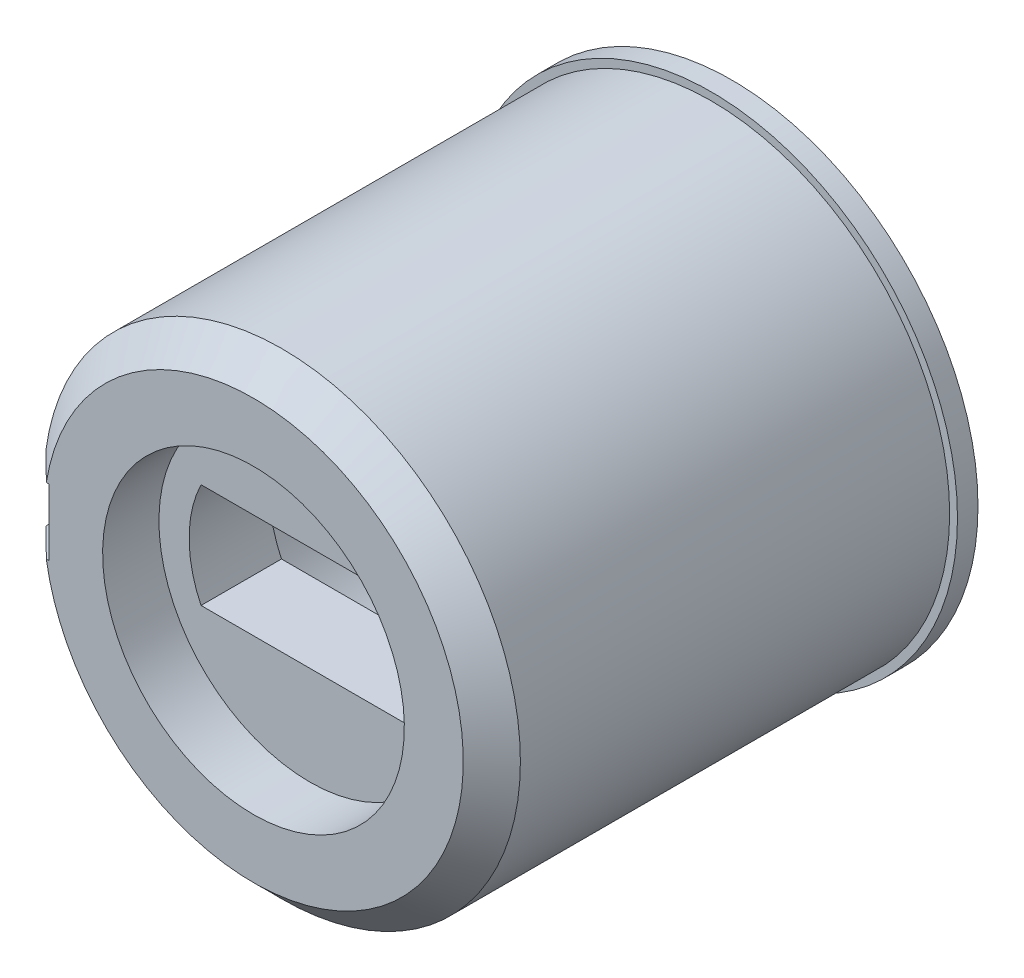
ISO-10303-21;
HEADER;
FILE_DESCRIPTION(('STEP AP214'),'2;1');
FILE_NAME('part.step','',(''),(''),'','','');
FILE_SCHEMA(('AUTOMOTIVE_DESIGN { 1 0 10303 214 1 1 1 1 }'));
ENDSEC;
DATA;
#1=APPLICATION_CONTEXT('core data for automotive mechanical design processes');
#2=APPLICATION_PROTOCOL_DEFINITION('international standard','automotive_design',2000,#1);
#3=PRODUCT_CONTEXT('',#1,'mechanical');
#4=PRODUCT('Part','Part','',(#3));
#5=PRODUCT_RELATED_PRODUCT_CATEGORY('part','',(#4));
#6=PRODUCT_DEFINITION_FORMATION('','',#4);
#7=PRODUCT_DEFINITION_CONTEXT('part definition',#1,'design');
#8=PRODUCT_DEFINITION('design','',#6,#7);
#9=PRODUCT_DEFINITION_SHAPE('','',#8);
#10=(LENGTH_UNIT() NAMED_UNIT(*) SI_UNIT(.MILLI.,.METRE.));
#11=(NAMED_UNIT(*) PLANE_ANGLE_UNIT() SI_UNIT($,.RADIAN.));
#12=(NAMED_UNIT(*) SI_UNIT($,.STERADIAN.) SOLID_ANGLE_UNIT());
#13=UNCERTAINTY_MEASURE_WITH_UNIT(LENGTH_MEASURE(1.E-05),#10,'distance_accuracy_value','');
#14=(GEOMETRIC_REPRESENTATION_CONTEXT(3) GLOBAL_UNCERTAINTY_ASSIGNED_CONTEXT((#13)) GLOBAL_UNIT_ASSIGNED_CONTEXT((#10,
#11,#12)) REPRESENTATION_CONTEXT('',''));
#15=CARTESIAN_POINT('',(0.,0.,0.));
#16=DIRECTION('',(0.,0.,1.));
#17=DIRECTION('',(1.,0.,0.));
#18=AXIS2_PLACEMENT_3D('',#15,#16,#17);
#19=CARTESIAN_POINT('',(-2.70370116691916,-1.30000000000001,18.87));
#20=DIRECTION('',(0.,-1.,0.));
#21=DIRECTION('',(0.,0.,-1.));
#22=AXIS2_PLACEMENT_3D('',#19,#20,#21);
#23=PLANE('',#22);
#24=DIRECTION('',(0.,0.,-1.));
#25=VECTOR('',#24,1.);
#26=CARTESIAN_POINT('',(-2.70370116691915,-1.30000000000001,18.87));
#27=LINE('',#26,#25);
#28=CARTESIAN_POINT('',(-2.70370116691915,-1.30000000000001,16.87));
#29=VERTEX_POINT('',#28);
#30=CARTESIAN_POINT('',(-2.70370116691915,-1.30000000000001,18.87));
#31=VERTEX_POINT('',#30);
#32=EDGE_CURVE('E95',#29,#31,#27,.F.);
#33=ORIENTED_EDGE('',*,*,#32,.T.);
#34=DIRECTION('',(-1.,0.,0.));
#35=VECTOR('',#34,1.);
#36=CARTESIAN_POINT('',(0.,-1.30000000000001,18.87));
#37=LINE('',#36,#35);
#38=CARTESIAN_POINT('',(2.70370116691916,-1.3,18.87));
#39=VERTEX_POINT('',#38);
#40=EDGE_CURVE('E186',#31,#39,#37,.F.);
#41=ORIENTED_EDGE('',*,*,#40,.T.);
#42=DIRECTION('',(0.,0.,-1.));
#43=VECTOR('',#42,1.);
#44=CARTESIAN_POINT('',(2.70370116691916,-1.3,18.87));
#45=LINE('',#44,#43);
#46=CARTESIAN_POINT('',(2.70370116691916,-1.3,16.87));
#47=VERTEX_POINT('',#46);
#48=EDGE_CURVE('E109',#39,#47,#45,.T.);
#49=ORIENTED_EDGE('',*,*,#48,.T.);
#50=DIRECTION('',(-1.,0.,0.));
#51=VECTOR('',#50,1.);
#52=CARTESIAN_POINT('',(0.,-1.30000000000001,16.87));
#53=LINE('',#52,#51);
#54=EDGE_CURVE('E107',#29,#47,#53,.F.);
#55=ORIENTED_EDGE('',*,*,#54,.F.);
#56=EDGE_LOOP('',(#33,#41,#49,#55));
#57=FACE_BOUND('',#56,.T.);
#58=ADVANCED_FACE('F16',(#57),#23,.F.);
#59=CARTESIAN_POINT('',(0.,0.,18.87));
#60=DIRECTION('',(0.,0.,-1.));
#61=DIRECTION('',(0.,1.,0.));
#62=AXIS2_PLACEMENT_3D('',#59,#60,#61);
#63=CYLINDRICAL_SURFACE('',#62,3.);
#64=ORIENTED_EDGE('',*,*,#48,.F.);
#65=CARTESIAN_POINT('',(0.,0.,18.87));
#66=DIRECTION('',(0.,0.,-1.));
#67=DIRECTION('',(0.,1.,0.));
#68=AXIS2_PLACEMENT_3D('',#65,#66,#67);
#69=CIRCLE('',#68,3.);
#70=CARTESIAN_POINT('',(2.70370116691915,1.3,18.87));
#71=VERTEX_POINT('',#70);
#72=EDGE_CURVE('E185',#39,#71,#69,.F.);
#73=ORIENTED_EDGE('',*,*,#72,.T.);
#74=DIRECTION('',(0.,0.,1.));
#75=VECTOR('',#74,1.);
#76=CARTESIAN_POINT('',(2.70370116691915,1.3,18.87));
#77=LINE('',#76,#75);
#78=CARTESIAN_POINT('',(2.70370116691915,1.3,16.87));
#79=VERTEX_POINT('',#78);
#80=EDGE_CURVE('E104',#71,#79,#77,.F.);
#81=ORIENTED_EDGE('',*,*,#80,.T.);
#82=CARTESIAN_POINT('',(0.,0.,16.87));
#83=DIRECTION('',(0.,0.,-1.));
#84=DIRECTION('',(0.,1.,0.));
#85=AXIS2_PLACEMENT_3D('',#82,#83,#84);
#86=CIRCLE('',#85,3.);
#87=EDGE_CURVE('E113',#47,#79,#86,.F.);
#88=ORIENTED_EDGE('',*,*,#87,.F.);
#89=EDGE_LOOP('',(#64,#73,#81,#88));
#90=FACE_BOUND('',#89,.T.);
#91=ADVANCED_FACE('F368',(#90),#63,.F.);
#92=CARTESIAN_POINT('',(2.70370116691915,1.3,18.87));
#93=DIRECTION('',(0.,1.,0.));
#94=DIRECTION('',(0.,0.,1.));
#95=AXIS2_PLACEMENT_3D('',#92,#93,#94);
#96=PLANE('',#95);
#97=ORIENTED_EDGE('',*,*,#80,.F.);
#98=DIRECTION('',(-1.,0.,0.));
#99=VECTOR('',#98,1.);
#100=CARTESIAN_POINT('',(0.,1.3,18.87));
#101=LINE('',#100,#99);
#102=CARTESIAN_POINT('',(-2.70370116691915,1.3,18.87));
#103=VERTEX_POINT('',#102);
#104=EDGE_CURVE('E184',#71,#103,#101,.T.);
#105=ORIENTED_EDGE('',*,*,#104,.T.);
#106=DIRECTION('',(0.,0.,-1.));
#107=VECTOR('',#106,1.);
#108=CARTESIAN_POINT('',(-2.70370116691915,1.3,18.87));
#109=LINE('',#108,#107);
#110=CARTESIAN_POINT('',(-2.70370116691915,1.3,16.87));
#111=VERTEX_POINT('',#110);
#112=EDGE_CURVE('E90',#103,#111,#109,.T.);
#113=ORIENTED_EDGE('',*,*,#112,.T.);
#114=DIRECTION('',(-1.,0.,0.));
#115=VECTOR('',#114,1.);
#116=CARTESIAN_POINT('',(0.,1.3,16.87));
#117=LINE('',#116,#115);
#118=EDGE_CURVE('E117',#79,#111,#117,.T.);
#119=ORIENTED_EDGE('',*,*,#118,.F.);
#120=EDGE_LOOP('',(#97,#105,#113,#119));
#121=FACE_BOUND('',#120,.T.);
#122=ADVANCED_FACE('F359',(#121),#96,.F.);
#123=CARTESIAN_POINT('',(0.,0.,18.87));
#124=DIRECTION('',(0.,0.,-1.));
#125=DIRECTION('',(0.,1.,0.));
#126=AXIS2_PLACEMENT_3D('',#123,#124,#125);
#127=CYLINDRICAL_SURFACE('',#126,3.);
#128=ORIENTED_EDGE('',*,*,#112,.F.);
#129=CARTESIAN_POINT('',(0.,0.,18.87));
#130=DIRECTION('',(0.,0.,-1.));
#131=DIRECTION('',(0.,1.,0.));
#132=AXIS2_PLACEMENT_3D('',#129,#130,#131);
#133=CIRCLE('',#132,3.);
#134=EDGE_CURVE('E101',#103,#31,#133,.F.);
#135=ORIENTED_EDGE('',*,*,#134,.T.);
#136=ORIENTED_EDGE('',*,*,#32,.F.);
#137=CARTESIAN_POINT('',(0.,0.,16.87));
#138=DIRECTION('',(0.,0.,-1.));
#139=DIRECTION('',(0.,1.,0.));
#140=AXIS2_PLACEMENT_3D('',#137,#138,#139);
#141=CIRCLE('',#140,3.);
#142=EDGE_CURVE('E19',#111,#29,#141,.F.);
#143=ORIENTED_EDGE('',*,*,#142,.F.);
#144=EDGE_LOOP('',(#128,#135,#136,#143));
#145=FACE_BOUND('',#144,.T.);
#146=ADVANCED_FACE('F97',(#145),#127,.F.);
#147=CARTESIAN_POINT('',(0.,0.,16.87));
#148=DIRECTION('',(0.,0.,-1.));
#149=DIRECTION('',(-1.,0.,0.));
#150=AXIS2_PLACEMENT_3D('',#147,#148,#149);
#151=PLANE('',#150);
#152=ORIENTED_EDGE('',*,*,#87,.T.);
#153=ORIENTED_EDGE('',*,*,#118,.T.);
#154=ORIENTED_EDGE('',*,*,#142,.T.);
#155=ORIENTED_EDGE('',*,*,#54,.T.);
#156=EDGE_LOOP('',(#152,#153,#154,#155));
#157=FACE_BOUND('',#156,.T.);
#158=CARTESIAN_POINT('',(0.,0.,16.87));
#159=DIRECTION('',(0.,0.,1.));
#160=DIRECTION('',(0.,-1.,0.));
#161=AXIS2_PLACEMENT_3D('',#158,#159,#160);
#162=CIRCLE('',#161,3.75);
#163=CARTESIAN_POINT('',(0.,-3.75,16.87));
#164=VERTEX_POINT('',#163);
#165=EDGE_CURVE('E180',#164,#164,#162,.F.);
#166=ORIENTED_EDGE('',*,*,#165,.T.);
#167=EDGE_LOOP('',(#166));
#168=FACE_BOUND('',#167,.T.);
#169=ADVANCED_FACE('F115',(#157,#168),#151,.T.);
#170=CARTESIAN_POINT('',(0.,0.,18.87));
#171=DIRECTION('',(0.,0.,-1.));
#172=DIRECTION('',(-1.,0.,0.));
#173=AXIS2_PLACEMENT_3D('',#170,#171,#172);
#174=PLANE('',#173);
#175=ORIENTED_EDGE('',*,*,#104,.F.);
#176=ORIENTED_EDGE('',*,*,#72,.F.);
#177=ORIENTED_EDGE('',*,*,#40,.F.);
#178=ORIENTED_EDGE('',*,*,#134,.F.);
#179=EDGE_LOOP('',(#175,#176,#177,#178));
#180=FACE_BOUND('',#179,.T.);
#181=CARTESIAN_POINT('',(0.,0.,18.87));
#182=DIRECTION('',(0.,0.,1.));
#183=DIRECTION('',(0.,-1.,0.));
#184=AXIS2_PLACEMENT_3D('',#181,#182,#183);
#185=CIRCLE('',#184,3.75);
#186=CARTESIAN_POINT('',(0.,-3.75,18.87));
#187=VERTEX_POINT('',#186);
#188=EDGE_CURVE('E176',#187,#187,#185,.T.);
#189=ORIENTED_EDGE('',*,*,#188,.T.);
#190=EDGE_LOOP('',(#189));
#191=FACE_BOUND('',#190,.T.);
#192=ADVANCED_FACE('F332',(#180,#191),#174,.F.);
#193=CARTESIAN_POINT('',(0.,0.,8.89));
#194=DIRECTION('',(0.,0.,1.));
#195=DIRECTION('',(0.,-1.,0.));
#196=AXIS2_PLACEMENT_3D('',#193,#194,#195);
#197=CYLINDRICAL_SURFACE('',#196,3.75);
#198=ORIENTED_EDGE('',*,*,#165,.F.);
#199=EDGE_LOOP('',(#198));
#200=FACE_BOUND('',#199,.T.);
#201=CARTESIAN_POINT('',(0.,0.,8.38));
#202=DIRECTION('',(0.,0.,1.));
#203=DIRECTION('',(0.,-1.,0.));
#204=AXIS2_PLACEMENT_3D('',#201,#202,#203);
#205=CIRCLE('',#204,3.75);
#206=CARTESIAN_POINT('',(0.,-3.75,8.37999999999999));
#207=VERTEX_POINT('',#206);
#208=EDGE_CURVE('E171',#207,#207,#205,.F.);
#209=ORIENTED_EDGE('',*,*,#208,.T.);
#210=EDGE_LOOP('',(#209));
#211=FACE_BOUND('',#210,.T.);
#212=ADVANCED_FACE('F322',(#200,#211),#197,.F.);
#213=CARTESIAN_POINT('',(0.,0.,8.89));
#214=DIRECTION('',(0.,0.,1.));
#215=DIRECTION('',(0.,-1.,0.));
#216=AXIS2_PLACEMENT_3D('',#213,#214,#215);
#217=CYLINDRICAL_SURFACE('',#216,3.75);
#218=CARTESIAN_POINT('',(0.,0.,20.27));
#219=DIRECTION('',(0.,0.,1.));
#220=DIRECTION('',(0.,-1.,0.));
#221=AXIS2_PLACEMENT_3D('',#218,#219,#220);
#222=CIRCLE('',#221,3.75);
#223=CARTESIAN_POINT('',(0.,-3.75,20.27));
#224=VERTEX_POINT('',#223);
#225=EDGE_CURVE('E167',#224,#224,#222,.F.);
#226=ORIENTED_EDGE('',*,*,#225,.F.);
#227=EDGE_LOOP('',(#226));
#228=FACE_BOUND('',#227,.T.);
#229=ORIENTED_EDGE('',*,*,#188,.F.);
#230=EDGE_LOOP('',(#229));
#231=FACE_BOUND('',#230,.T.);
#232=ADVANCED_FACE('F270',(#228,#231),#217,.F.);
#233=CARTESIAN_POINT('',(0.,0.,8.38));
#234=DIRECTION('',(0.,0.,1.));
#235=DIRECTION('',(1.,0.,0.));
#236=AXIS2_PLACEMENT_3D('',#233,#234,#235);
#237=PLANE('',#236);
#238=ORIENTED_EDGE('',*,*,#208,.F.);
#239=EDGE_LOOP('',(#238));
#240=FACE_BOUND('',#239,.T.);
#241=DIRECTION('',(0.,1.,0.));
#242=VECTOR('',#241,1.);
#243=CARTESIAN_POINT('',(-5.07728216468239,0.,8.38));
#244=LINE('',#243,#242);
#245=CARTESIAN_POINT('',(-5.07728216468239,0.824999999999997,8.38));
#246=VERTEX_POINT('',#245);
#247=CARTESIAN_POINT('',(-5.07728216468239,-0.825000000000004,8.38));
#248=VERTEX_POINT('',#247);
#249=EDGE_CURVE('E193',#246,#248,#244,.F.);
#250=ORIENTED_EDGE('',*,*,#249,.F.);
#251=DIRECTION('',(1.,0.,0.));
#252=VECTOR('',#251,1.);
#253=CARTESIAN_POINT('',(0.,0.824999999999997,8.38));
#254=LINE('',#253,#252);
#255=CARTESIAN_POINT('',(-6.06413843839337,0.824999999999996,8.38));
#256=VERTEX_POINT('',#255);
#257=EDGE_CURVE('E179',#256,#246,#254,.T.);
#258=ORIENTED_EDGE('',*,*,#257,.F.);
#259=CARTESIAN_POINT('',(0.,0.,8.38));
#260=DIRECTION('',(0.,0.,-1.));
#261=DIRECTION('',(0.,1.,0.));
#262=AXIS2_PLACEMENT_3D('',#259,#260,#261);
#263=CIRCLE('',#262,6.12);
#264=CARTESIAN_POINT('',(-6.06413843839337,-0.825000000000004,8.38));
#265=VERTEX_POINT('',#264);
#266=EDGE_CURVE('E163',#265,#256,#263,.F.);
#267=ORIENTED_EDGE('',*,*,#266,.F.);
#268=DIRECTION('',(1.,0.,0.));
#269=VECTOR('',#268,1.);
#270=CARTESIAN_POINT('',(0.,-0.825000000000004,8.38));
#271=LINE('',#270,#269);
#272=EDGE_CURVE('E175',#248,#265,#271,.F.);
#273=ORIENTED_EDGE('',*,*,#272,.F.);
#274=EDGE_LOOP('',(#250,#258,#267,#273));
#275=FACE_BOUND('',#274,.T.);
#276=ADVANCED_FACE('F251',(#240,#275),#237,.F.);
#277=CARTESIAN_POINT('',(-0.70559353233144,0.,20.27));
#278=DIRECTION('',(0.,0.,1.));
#279=DIRECTION('',(1.,0.,0.));
#280=AXIS2_PLACEMENT_3D('',#277,#278,#279);
#281=PLANE('',#280);
#282=ORIENTED_EDGE('',*,*,#225,.T.);
#283=EDGE_LOOP('',(#282));
#284=FACE_BOUND('',#283,.T.);
#285=DIRECTION('',(0.,1.,0.));
#286=VECTOR('',#285,1.);
#287=CARTESIAN_POINT('',(-5.07728216468239,-0.825000000000004,20.27));
#288=LINE('',#287,#286);
#289=CARTESIAN_POINT('',(-5.07728216468238,-0.825000000000007,20.27));
#290=VERTEX_POINT('',#289);
#291=CARTESIAN_POINT('',(-5.07728216468238,0.824999999999993,20.27));
#292=VERTEX_POINT('',#291);
#293=EDGE_CURVE('E162',#290,#292,#288,.T.);
#294=ORIENTED_EDGE('',*,*,#293,.F.);
#295=DIRECTION('',(1.,0.,0.));
#296=VECTOR('',#295,1.);
#297=CARTESIAN_POINT('',(-0.70559353233144,-0.825000000000007,20.27));
#298=LINE('',#297,#296);
#299=CARTESIAN_POINT('',(-5.14933005407242,-0.825000000000007,20.2700000001901));
#300=VERTEX_POINT('',#299);
#301=EDGE_CURVE('E170',#290,#300,#298,.F.);
#302=ORIENTED_EDGE('',*,*,#301,.T.);
#303=CARTESIAN_POINT('',(0.,0.,20.2700000003802));
#304=DIRECTION('',(0.,0.,-1.));
#305=DIRECTION('',(0.,1.,0.));
#306=AXIS2_PLACEMENT_3D('',#303,#304,#305);
#307=CIRCLE('',#306,5.21500000036347);
#308=CARTESIAN_POINT('',(-5.14933005407242,0.824999999999995,20.2700000001901));
#309=VERTEX_POINT('',#308);
#310=EDGE_CURVE('E159',#309,#300,#307,.T.);
#311=ORIENTED_EDGE('',*,*,#310,.F.);
#312=DIRECTION('',(1.,0.,0.));
#313=VECTOR('',#312,1.);
#314=CARTESIAN_POINT('',(-0.70559353233144,0.824999999999993,20.27));
#315=LINE('',#314,#313);
#316=EDGE_CURVE('E174',#309,#292,#315,.T.);
#317=ORIENTED_EDGE('',*,*,#316,.T.);
#318=EDGE_LOOP('',(#294,#302,#311,#317));
#319=FACE_BOUND('',#318,.T.);
#320=ADVANCED_FACE('F258',(#284,#319),#281,.T.);
#321=CARTESIAN_POINT('',(0.,0.,8.89));
#322=DIRECTION('',(0.,0.,-1.));
#323=DIRECTION('',(0.,1.,0.));
#324=AXIS2_PLACEMENT_3D('',#321,#322,#323);
#325=CYLINDRICAL_SURFACE('',#324,6.12);
#326=DIRECTION('',(0.,0.,-1.));
#327=VECTOR('',#326,1.);
#328=CARTESIAN_POINT('',(-6.06413843839337,0.824999999999995,8.89));
#329=LINE('',#328,#327);
#330=CARTESIAN_POINT('',(-6.06413843839337,0.824999999999995,8.89));
#331=VERTEX_POINT('',#330);
#332=EDGE_CURVE('E166',#256,#331,#329,.F.);
#333=ORIENTED_EDGE('',*,*,#332,.T.);
#334=CARTESIAN_POINT('',(0.,0.,8.89));
#335=DIRECTION('',(0.,0.,-1.));
#336=DIRECTION('',(0.,1.,0.));
#337=AXIS2_PLACEMENT_3D('',#334,#335,#336);
#338=CIRCLE('',#337,6.12);
#339=CARTESIAN_POINT('',(-6.06413843839337,-0.825000000000003,8.89));
#340=VERTEX_POINT('',#339);
#341=EDGE_CURVE('E134',#340,#331,#338,.F.);
#342=ORIENTED_EDGE('',*,*,#341,.F.);
#343=DIRECTION('',(0.,0.,1.));
#344=VECTOR('',#343,1.);
#345=CARTESIAN_POINT('',(-6.06413843839337,-0.825000000000003,8.89));
#346=LINE('',#345,#344);
#347=EDGE_CURVE('E206',#265,#340,#346,.T.);
#348=ORIENTED_EDGE('',*,*,#347,.F.);
#349=ORIENTED_EDGE('',*,*,#266,.T.);
#350=EDGE_LOOP('',(#333,#342,#348,#349));
#351=FACE_BOUND('',#350,.T.);
#352=ADVANCED_FACE('F248',(#351),#325,.T.);
#353=CARTESIAN_POINT('',(-5.07728216468239,-0.825000000000004,8.89));
#354=DIRECTION('',(-1.,0.,0.));
#355=DIRECTION('',(0.,0.,1.));
#356=AXIS2_PLACEMENT_3D('',#353,#354,#355);
#357=PLANE('',#356);
#358=ORIENTED_EDGE('',*,*,#249,.T.);
#359=DIRECTION('',(0.,0.,1.));
#360=VECTOR('',#359,1.);
#361=CARTESIAN_POINT('',(-5.07728216468239,-0.825000000000003,8.89));
#362=LINE('',#361,#360);
#363=EDGE_CURVE('E158',#290,#248,#362,.F.);
#364=ORIENTED_EDGE('',*,*,#363,.F.);
#365=ORIENTED_EDGE('',*,*,#293,.T.);
#366=DIRECTION('',(0.,0.,-1.));
#367=VECTOR('',#366,1.);
#368=CARTESIAN_POINT('',(-5.07728216468239,0.824999999999996,8.89));
#369=LINE('',#368,#367);
#370=EDGE_CURVE('E198',#246,#292,#369,.F.);
#371=ORIENTED_EDGE('',*,*,#370,.F.);
#372=EDGE_LOOP('',(#358,#364,#365,#371));
#373=FACE_BOUND('',#372,.T.);
#374=ADVANCED_FACE('F146',(#373),#357,.T.);
#375=CARTESIAN_POINT('',(0.,0.,19.559999999899));
#376=DIRECTION('',(0.,0.,-1.));
#377=DIRECTION('',(0.,1.,0.));
#378=AXIS2_PLACEMENT_3D('',#375,#376,#377);
#379=CONICAL_SURFACE('',#378,5.924999999587,0.785398162511794);
#380=CARTESIAN_POINT('',(-5.14933005379017,0.824999999853882,20.2700000002852));
#381=CARTESIAN_POINT('',(-5.26907367806447,0.824999999926939,20.1517525553965));
#382=CARTESIAN_POINT('',(-5.3887748332454,0.824999999975644,20.033462165754));
#383=CARTESIAN_POINT('',(-5.62809220345579,0.825000000024348,19.7967954989043));
#384=CARTESIAN_POINT('',(-5.74770841848664,0.825000000024348,19.6784192216985));
#385=CARTESIAN_POINT('',(-5.86728216442552,0.824999999999996,19.5599999997404));
#386=B_SPLINE_CURVE_WITH_KNOTS('',3,(#380,#381,#382,#383,#384,#385),.UNSPECIFIED.,.F.,.F.,(4,2,
4),(0.,0.504865175567567,1.00973034284556),.UNSPECIFIED.);
#387=CARTESIAN_POINT('',(-5.86728216455389,0.824999999999995,19.5599999998702));
#388=VERTEX_POINT('',#387);
#389=EDGE_CURVE('E125',#309,#388,#386,.T.);
#390=ORIENTED_EDGE('',*,*,#389,.F.);
#391=ORIENTED_EDGE('',*,*,#310,.T.);
#392=CARTESIAN_POINT('',(-5.86728216450942,-0.825000000131827,19.5599999998253));
#393=CARTESIAN_POINT('',(-5.74770841851328,-0.825000000065915,19.6784192217255));
#394=CARTESIAN_POINT('',(-5.62809220345445,-0.825000000021973,19.796795498903));
#395=CARTESIAN_POINT('',(-5.38877483324673,-0.824999999978032,20.0334621657553));
#396=CARTESIAN_POINT('',(-5.26907367809643,-0.824999999978032,20.1517525554288));
#397=CARTESIAN_POINT('',(-5.14933005388206,-0.825000000000003,20.270000000378));
#398=B_SPLINE_CURVE_WITH_KNOTS('',3,(#392,#393,#394,#395,#396,#397),.UNSPECIFIED.,.F.,.F.,(4,2,
4),(0.,0.504865167277862,1.00973034284529),.UNSPECIFIED.);
#399=CARTESIAN_POINT('',(-5.86728216455389,-0.825000000000003,19.5599999998702));
#400=VERTEX_POINT('',#399);
#401=EDGE_CURVE('E151',#400,#300,#398,.T.);
#402=ORIENTED_EDGE('',*,*,#401,.F.);
#403=CARTESIAN_POINT('',(0.,0.,19.56));
#404=DIRECTION('',(0.,0.,1.));
#405=DIRECTION('',(0.,-1.,0.));
#406=AXIS2_PLACEMENT_3D('',#403,#404,#405);
#407=CIRCLE('',#406,5.925);
#408=EDGE_CURVE('E201',#388,#400,#407,.F.);
#409=ORIENTED_EDGE('',*,*,#408,.F.);
#410=EDGE_LOOP('',(#390,#391,#402,#409));
#411=FACE_BOUND('',#410,.T.);
#412=ADVANCED_FACE('F140',(#411),#379,.T.);
#413=CARTESIAN_POINT('',(-5.86728216468238,-0.825000000000003,8.89));
#414=DIRECTION('',(0.,1.,0.));
#415=DIRECTION('',(0.,0.,1.));
#416=AXIS2_PLACEMENT_3D('',#413,#414,#415);
#417=PLANE('',#416);
#418=DIRECTION('',(1.,0.,0.));
#419=VECTOR('',#418,1.);
#420=CARTESIAN_POINT('',(0.,-0.825000000000003,8.89));
#421=LINE('',#420,#419);
#422=CARTESIAN_POINT('',(-5.86728216468238,-0.825000000000001,8.89));
#423=VERTEX_POINT('',#422);
#424=EDGE_CURVE('E226',#423,#340,#421,.F.);
#425=ORIENTED_EDGE('',*,*,#424,.F.);
#426=DIRECTION('',(0.,0.,1.));
#427=VECTOR('',#426,1.);
#428=CARTESIAN_POINT('',(-5.86728216468238,-0.825,8.89));
#429=LINE('',#428,#427);
#430=EDGE_CURVE('E124',#400,#423,#429,.F.);
#431=ORIENTED_EDGE('',*,*,#430,.F.);
#432=ORIENTED_EDGE('',*,*,#401,.T.);
#433=ORIENTED_EDGE('',*,*,#301,.F.);
#434=ORIENTED_EDGE('',*,*,#363,.T.);
#435=ORIENTED_EDGE('',*,*,#272,.T.);
#436=ORIENTED_EDGE('',*,*,#347,.T.);
#437=EDGE_LOOP('',(#425,#431,#432,#433,#434,#435,#436));
#438=FACE_BOUND('',#437,.T.);
#439=ADVANCED_FACE('F145',(#438),#417,.T.);
#440=CARTESIAN_POINT('',(0.,0.,8.89));
#441=DIRECTION('',(0.,0.,1.));
#442=DIRECTION('',(1.,0.,0.));
#443=AXIS2_PLACEMENT_3D('',#440,#441,#442);
#444=PLANE('',#443);
#445=DIRECTION('',(1.,0.,0.));
#446=VECTOR('',#445,1.);
#447=CARTESIAN_POINT('',(-5.07728216468238,0.824999999999996,8.89));
#448=LINE('',#447,#446);
#449=CARTESIAN_POINT('',(-5.86728216468238,0.824999999999997,8.89));
#450=VERTEX_POINT('',#449);
#451=EDGE_CURVE('E34',#450,#331,#448,.F.);
#452=ORIENTED_EDGE('',*,*,#451,.F.);
#453=CARTESIAN_POINT('',(0.,0.,8.89));
#454=DIRECTION('',(0.,0.,1.));
#455=DIRECTION('',(0.,-1.,0.));
#456=AXIS2_PLACEMENT_3D('',#453,#454,#455);
#457=CIRCLE('',#456,5.925);
#458=EDGE_CURVE('E25',#423,#450,#457,.T.);
#459=ORIENTED_EDGE('',*,*,#458,.F.);
#460=ORIENTED_EDGE('',*,*,#424,.T.);
#461=ORIENTED_EDGE('',*,*,#341,.T.);
#462=EDGE_LOOP('',(#452,#459,#460,#461));
#463=FACE_BOUND('',#462,.T.);
#464=ADVANCED_FACE('F235',(#463),#444,.T.);
#465=CARTESIAN_POINT('',(-5.07728216468238,0.824999999999996,8.89));
#466=DIRECTION('',(0.,-1.,0.));
#467=DIRECTION('',(0.,0.,-1.));
#468=AXIS2_PLACEMENT_3D('',#465,#466,#467);
#469=PLANE('',#468);
#470=ORIENTED_EDGE('',*,*,#370,.T.);
#471=ORIENTED_EDGE('',*,*,#316,.F.);
#472=ORIENTED_EDGE('',*,*,#389,.T.);
#473=DIRECTION('',(0.,0.,1.));
#474=VECTOR('',#473,1.);
#475=CARTESIAN_POINT('',(-5.86728216468238,0.824999999999997,8.89));
#476=LINE('',#475,#474);
#477=EDGE_CURVE('E11',#450,#388,#476,.T.);
#478=ORIENTED_EDGE('',*,*,#477,.F.);
#479=ORIENTED_EDGE('',*,*,#451,.T.);
#480=ORIENTED_EDGE('',*,*,#332,.F.);
#481=ORIENTED_EDGE('',*,*,#257,.T.);
#482=EDGE_LOOP('',(#470,#471,#472,#478,#479,#480,#481));
#483=FACE_BOUND('',#482,.T.);
#484=ADVANCED_FACE('F136',(#483),#469,.T.);
#485=CARTESIAN_POINT('',(0.,0.,8.89));
#486=DIRECTION('',(0.,0.,1.));
#487=DIRECTION('',(0.,-1.,0.));
#488=AXIS2_PLACEMENT_3D('',#485,#486,#487);
#489=CYLINDRICAL_SURFACE('',#488,5.925);
#490=ORIENTED_EDGE('',*,*,#458,.T.);
#491=ORIENTED_EDGE('',*,*,#477,.T.);
#492=ORIENTED_EDGE('',*,*,#408,.T.);
#493=ORIENTED_EDGE('',*,*,#430,.T.);
#494=EDGE_LOOP('',(#490,#491,#492,#493));
#495=FACE_BOUND('',#494,.T.);
#496=ADVANCED_FACE('F242',(#495),#489,.T.);
#497=CLOSED_SHELL('',(#58,#91,#122,#146,#169,#192,#212,#232,#276,#320,#352,#374,#412,#439,#464,
#484,#496));
#498=MANIFOLD_SOLID_BREP('B1',#497);
#499=ADVANCED_BREP_SHAPE_REPRESENTATION('',(#18,#498),#14);
#500=SHAPE_DEFINITION_REPRESENTATION(#9,#499);
ENDSEC;
END-ISO-10303-21;
